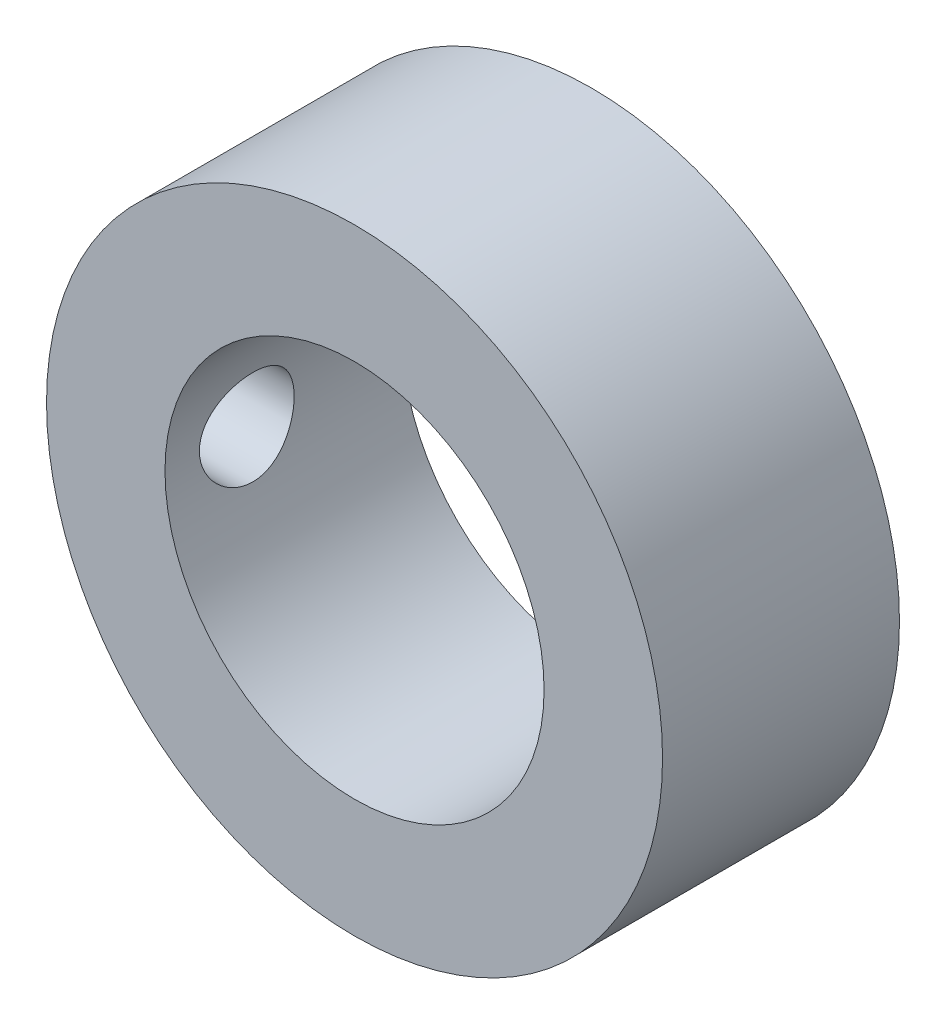
ISO-10303-21;
HEADER;
FILE_DESCRIPTION(('STEP AP214'),'2;1');
FILE_NAME('part.step','',(''),(''),'','','');
FILE_SCHEMA(('AUTOMOTIVE_DESIGN { 1 0 10303 214 1 1 1 1 }'));
ENDSEC;
DATA;
#1=APPLICATION_CONTEXT('core data for automotive mechanical design processes');
#2=APPLICATION_PROTOCOL_DEFINITION('international standard','automotive_design',2000,#1);
#3=PRODUCT_CONTEXT('',#1,'mechanical');
#4=PRODUCT('Part','Part','',(#3));
#5=PRODUCT_RELATED_PRODUCT_CATEGORY('part','',(#4));
#6=PRODUCT_DEFINITION_FORMATION('','',#4);
#7=PRODUCT_DEFINITION_CONTEXT('part definition',#1,'design');
#8=PRODUCT_DEFINITION('design','',#6,#7);
#9=PRODUCT_DEFINITION_SHAPE('','',#8);
#10=(LENGTH_UNIT() NAMED_UNIT(*) SI_UNIT(.MILLI.,.METRE.));
#11=(NAMED_UNIT(*) PLANE_ANGLE_UNIT() SI_UNIT($,.RADIAN.));
#12=(NAMED_UNIT(*) SI_UNIT($,.STERADIAN.) SOLID_ANGLE_UNIT());
#13=UNCERTAINTY_MEASURE_WITH_UNIT(LENGTH_MEASURE(1.E-05),#10,'distance_accuracy_value','');
#14=(GEOMETRIC_REPRESENTATION_CONTEXT(3) GLOBAL_UNCERTAINTY_ASSIGNED_CONTEXT((#13)) GLOBAL_UNIT_ASSIGNED_CONTEXT((#10,
#11,#12)) REPRESENTATION_CONTEXT('',''));
#15=CARTESIAN_POINT('',(0.,0.,0.));
#16=DIRECTION('',(0.,0.,1.));
#17=DIRECTION('',(1.,0.,0.));
#18=AXIS2_PLACEMENT_3D('',#15,#16,#17);
#19=CARTESIAN_POINT('',(0.,0.,5.));
#20=DIRECTION('',(0.,0.,1.));
#21=DIRECTION('',(1.,0.,0.));
#22=AXIS2_PLACEMENT_3D('',#19,#20,#21);
#23=PLANE('',#22);
#24=CARTESIAN_POINT('',(0.,0.,5.));
#25=DIRECTION('',(0.,0.,1.));
#26=DIRECTION('',(1.,0.,0.));
#27=AXIS2_PLACEMENT_3D('',#24,#25,#26);
#28=CIRCLE('',#27,6.5);
#29=CARTESIAN_POINT('',(6.5,0.,5.));
#30=VERTEX_POINT('',#29);
#31=EDGE_CURVE('E10',#30,#30,#28,.T.);
#32=ORIENTED_EDGE('',*,*,#31,.T.);
#33=EDGE_LOOP('',(#32));
#34=FACE_BOUND('',#33,.T.);
#35=CARTESIAN_POINT('',(0.,0.,5.));
#36=DIRECTION('',(0.,0.,1.));
#37=DIRECTION('',(1.,0.,0.));
#38=AXIS2_PLACEMENT_3D('',#35,#36,#37);
#39=CIRCLE('',#38,4.);
#40=CARTESIAN_POINT('',(4.,0.,5.));
#41=VERTEX_POINT('',#40);
#42=EDGE_CURVE('E47',#41,#41,#39,.T.);
#43=ORIENTED_EDGE('',*,*,#42,.F.);
#44=EDGE_LOOP('',(#43));
#45=FACE_BOUND('',#44,.T.);
#46=ADVANCED_FACE('F29',(#34,#45),#23,.T.);
#47=CARTESIAN_POINT('',(0.,0.,0.));
#48=DIRECTION('',(0.,0.,1.));
#49=DIRECTION('',(1.,0.,0.));
#50=AXIS2_PLACEMENT_3D('',#47,#48,#49);
#51=PLANE('',#50);
#52=CARTESIAN_POINT('',(0.,0.,0.));
#53=DIRECTION('',(0.,0.,1.));
#54=DIRECTION('',(1.,0.,0.));
#55=AXIS2_PLACEMENT_3D('',#52,#53,#54);
#56=CIRCLE('',#55,6.5);
#57=CARTESIAN_POINT('',(6.5,0.,0.));
#58=VERTEX_POINT('',#57);
#59=EDGE_CURVE('E42',#58,#58,#56,.T.);
#60=ORIENTED_EDGE('',*,*,#59,.F.);
#61=EDGE_LOOP('',(#60));
#62=FACE_BOUND('',#61,.T.);
#63=CARTESIAN_POINT('',(0.,0.,0.));
#64=DIRECTION('',(0.,0.,1.));
#65=DIRECTION('',(1.,0.,0.));
#66=AXIS2_PLACEMENT_3D('',#63,#64,#65);
#67=CIRCLE('',#66,4.);
#68=CARTESIAN_POINT('',(4.,0.,0.));
#69=VERTEX_POINT('',#68);
#70=EDGE_CURVE('E49',#69,#69,#67,.T.);
#71=ORIENTED_EDGE('',*,*,#70,.T.);
#72=EDGE_LOOP('',(#71));
#73=FACE_BOUND('',#72,.T.);
#74=ADVANCED_FACE('F69',(#62,#73),#51,.F.);
#75=CARTESIAN_POINT('',(0.,0.,5.));
#76=DIRECTION('',(0.,0.,-1.));
#77=DIRECTION('',(-1.,0.,0.));
#78=AXIS2_PLACEMENT_3D('',#75,#76,#77);
#79=CYLINDRICAL_SURFACE('',#78,6.5);
#80=CARTESIAN_POINT('',(-6.5,0.,2.27451248703502));
#81=CARTESIAN_POINT('',(-6.49999908992167,0.055817064729886,2.27451477553336));
#82=CARTESIAN_POINT('',(-6.49927350343274,0.11166609146456,2.2792015833515));
#83=CARTESIAN_POINT('',(-6.49644883563929,0.221801899824004,2.29781956022329));
#84=CARTESIAN_POINT('',(-6.49434843348197,0.276087126613348,2.31175961951114));
#85=CARTESIAN_POINT('',(-6.48901007251788,0.381485610883513,2.34845670936924));
#86=CARTESIAN_POINT('',(-6.48577298944175,0.432601274714583,2.37120695371138));
#87=CARTESIAN_POINT('',(-6.47851856984632,0.530282085271046,2.42486176451074));
#88=CARTESIAN_POINT('',(-6.47450133744396,0.576847837971894,2.45576524305334));
#89=CARTESIAN_POINT('',(-6.46609620155979,0.664496386012373,2.52511921389002));
#90=CARTESIAN_POINT('',(-6.46170579545351,0.705536460731055,2.56362339830884));
#91=CARTESIAN_POINT('',(-6.45306862956897,0.780599991187495,2.6469702378492));
#92=CARTESIAN_POINT('',(-6.44882187823779,0.814623034912151,2.69181326490282));
#93=CARTESIAN_POINT('',(-6.44092858480929,0.874854121170247,2.78685334842795));
#94=CARTESIAN_POINT('',(-6.43728527709901,0.901020625150246,2.83707702166757));
#95=CARTESIAN_POINT('',(-6.43104567686631,0.94453036662908,2.9412719265677));
#96=CARTESIAN_POINT('',(-6.42844932428087,0.961874110297863,2.99524294303772));
#97=CARTESIAN_POINT('',(-6.4246222788149,0.987112895661808,3.10495038251229));
#98=CARTESIAN_POINT('',(-6.42338100001967,0.995081217378878,3.1606695709776));
#99=CARTESIAN_POINT('',(-6.42237253279063,1.00157002465742,3.27266695198738));
#100=CARTESIAN_POINT('',(-6.42260525537728,1.00009108051243,3.32894511058429));
#101=CARTESIAN_POINT('',(-6.42450881933126,0.987787179811824,3.43994403886675));
#102=CARTESIAN_POINT('',(-6.42616707775449,0.977043994441648,3.49467411958995));
#103=CARTESIAN_POINT('',(-6.43071520435033,0.946644646972411,3.60154552816723));
#104=CARTESIAN_POINT('',(-6.43360510901605,0.926988220777025,3.65368677926436));
#105=CARTESIAN_POINT('',(-6.44030473958811,0.879235795084032,3.75414833588555));
#106=CARTESIAN_POINT('',(-6.44411821123387,0.851105310804899,3.8024519897075));
#107=CARTESIAN_POINT('',(-6.4522326103619,0.78722783237411,3.89368436170275));
#108=CARTESIAN_POINT('',(-6.45653357146213,0.751480312791105,3.93661270875706));
#109=CARTESIAN_POINT('',(-6.46519386756059,0.67293538705475,4.01634967565635));
#110=CARTESIAN_POINT('',(-6.469553340338,0.630067708624352,4.05308909407197));
#111=CARTESIAN_POINT('',(-6.47779744041346,0.538738417865615,4.11886293895054));
#112=CARTESIAN_POINT('',(-6.48168206543197,0.490276778685255,4.14789732842575));
#113=CARTESIAN_POINT('',(-6.488543145454,0.389074104610937,4.19744109963044));
#114=CARTESIAN_POINT('',(-6.4915190130639,0.336330329631682,4.21794497057715));
#115=CARTESIAN_POINT('',(-6.496222414473,0.228092040845377,4.24978461540683));
#116=CARTESIAN_POINT('',(-6.49795003709237,0.172597723056377,4.26112104161565));
#117=CARTESIAN_POINT('',(-6.49995048880449,0.0610307068281496,4.27421158112463));
#118=CARTESIAN_POINT('',(-6.50023775644299,0.00496941707415943,4.27606080136799));
#119=CARTESIAN_POINT('',(-6.49936448789232,-0.106662529346365,4.27037712723291));
#120=CARTESIAN_POINT('',(-6.49820399892325,-0.162233201955357,4.26284453885197));
#121=CARTESIAN_POINT('',(-6.49457454189283,-0.271017124248255,4.23869016173058));
#122=CARTESIAN_POINT('',(-6.49211227023231,-0.32424094186448,4.2221148750519));
#123=CARTESIAN_POINT('',(-6.48615438698457,-0.427154143969837,4.18039476985395));
#124=CARTESIAN_POINT('',(-6.48265872470663,-0.476843354928232,4.15524953094524));
#125=CARTESIAN_POINT('',(-6.47498649883332,-0.57169392957572,4.09688135364179));
#126=CARTESIAN_POINT('',(-6.47080494696501,-0.616817882496432,4.06359828915746));
#127=CARTESIAN_POINT('',(-6.46224144209134,-0.700873697592618,3.98998273232548));
#128=CARTESIAN_POINT('',(-6.45785947681222,-0.739805179872141,3.94964980780106));
#129=CARTESIAN_POINT('',(-6.44934303476859,-0.81071843588531,3.86265532156035));
#130=CARTESIAN_POINT('',(-6.44521106232414,-0.842636341270653,3.81594141500798));
#131=CARTESIAN_POINT('',(-6.43770733047634,-0.898172001876273,3.71775929880923));
#132=CARTESIAN_POINT('',(-6.43433554970647,-0.92178999039054,3.66629122284436));
#133=CARTESIAN_POINT('',(-6.42875224541018,-0.959957166104304,3.56024956954266));
#134=CARTESIAN_POINT('',(-6.42653647836275,-0.97453955891243,3.50568817711425));
#135=CARTESIAN_POINT('',(-6.42350493549769,-0.994327036223546,3.39485398093342));
#136=CARTESIAN_POINT('',(-6.42268905751876,-0.999532805016491,3.33858130237254));
#137=CARTESIAN_POINT('',(-6.42255361649409,-1.00040235728518,3.22655875191229));
#138=CARTESIAN_POINT('',(-6.42321830228211,-0.996166585462345,3.17080965286747));
#139=CARTESIAN_POINT('',(-6.42593479927824,-0.97848897403827,3.06082688200797));
#140=CARTESIAN_POINT('',(-6.42798660779263,-0.965047152314781,3.00659320725061));
#141=CARTESIAN_POINT('',(-6.43324054942212,-0.929375191043097,2.90121106641621));
#142=CARTESIAN_POINT('',(-6.43644171586274,-0.907152435178954,2.85006004974548));
#143=CARTESIAN_POINT('',(-6.44363480220168,-0.854559485882902,2.75219615254446));
#144=CARTESIAN_POINT('',(-6.44762675166756,-0.824188987789906,2.70548343806001));
#145=CARTESIAN_POINT('',(-6.45600209982988,-0.755799150201771,2.61731243846299));
#146=CARTESIAN_POINT('',(-6.46038905079967,-0.717705522953786,2.57591210505067));
#147=CARTESIAN_POINT('',(-6.46903074380989,-0.635107757993179,2.50005610605368));
#148=CARTESIAN_POINT('',(-6.47328545494089,-0.590602135052723,2.46560205390358));
#149=CARTESIAN_POINT('',(-6.4812116043899,-0.496138861148413,2.40443687997911));
#150=CARTESIAN_POINT('',(-6.48487951200506,-0.446151049768046,2.37777188533883));
#151=CARTESIAN_POINT('',(-6.4911842414916,-0.342372563409436,2.33325675532085));
#152=CARTESIAN_POINT('',(-6.49382212163167,-0.288585858953371,2.31539756771453));
#153=CARTESIAN_POINT('',(-6.49717328640608,-0.195470700034543,2.29301391830033));
#154=CARTESIAN_POINT('',(-6.49822781110073,-0.156714587663259,2.28608659630501));
#155=CARTESIAN_POINT('',(-6.49964148386525,-0.0786442681971829,2.27683510528157));
#156=CARTESIAN_POINT('',(-6.50000064126345,-0.0393300685962364,2.27451087450313));
#157=CARTESIAN_POINT('',(-6.5,0.,2.27451248703502));
#158=B_SPLINE_CURVE_WITH_KNOTS('',3,(#80,#81,#82,#83,#84,#85,#86,#87,#88,#89,#90,#91,#92,#93,
#94,#95,#96,#97,#98,#99,#100,#101,#102,#103,#104,#105,#106,#107,#108,#109,#110,#111,#112,#113,
#114,#115,#116,#117,#118,#119,#120,#121,#122,#123,#124,#125,#126,#127,#128,#129,#130,#131,#132,
#133,#134,#135,#136,#137,#138,#139,#140,#141,#142,#143,#144,#145,#146,#147,#148,#149,#150,#151,
#152,#153,#154,#155,#156,#157),.UNSPECIFIED.,.T.,.F.,(4,2,2,2,2,2,2,2,2,2,2,2,2,2,2,2,2,2,2,2,2,
2,2,2,2,2,2,2,2,2,2,2,2,2,2,2,2,2,4),(0.,0.167307467701377,0.334775912289476,0.502115616587677,
0.669433003445578,0.837977603302102,1.00653209663435,1.17596267229177,1.34538352646323,
1.51347116858973,1.68154866403561,1.84815762731508,2.01477152748461,2.18207283092673,
2.34938567873227,2.51846034912151,2.68753583113344,2.85672036828736,3.02589286575468,
3.19336608917139,3.36083385041674,3.52744841736623,3.69407115858382,3.86196430272231,
4.02986774280723,4.1992420476724,4.36861159138526,4.53735495577967,4.70608600507342,
4.87303057013561,5.03997481099962,5.20677897004386,5.37358936711325,5.54208769222918,
5.71062511000444,5.88014126810578,6.04948280110168,6.16737331520001,6.28526224779081),.UNSPECIFIED.);
#159=CARTESIAN_POINT('',(-6.5,0.,2.27451248703502));
#160=VERTEX_POINT('',#159);
#161=EDGE_CURVE('E52',#160,#160,#158,.T.);
#162=ORIENTED_EDGE('',*,*,#161,.T.);
#163=EDGE_LOOP('',(#162));
#164=FACE_BOUND('',#163,.T.);
#165=ORIENTED_EDGE('',*,*,#31,.F.);
#166=EDGE_LOOP('',(#165));
#167=FACE_BOUND('',#166,.T.);
#168=ORIENTED_EDGE('',*,*,#59,.T.);
#169=EDGE_LOOP('',(#168));
#170=FACE_BOUND('',#169,.T.);
#171=ADVANCED_FACE('F31',(#164,#167,#170),#79,.T.);
#172=CARTESIAN_POINT('',(0.,0.,5.));
#173=DIRECTION('',(0.,0.,-1.));
#174=DIRECTION('',(-1.,0.,0.));
#175=AXIS2_PLACEMENT_3D('',#172,#173,#174);
#176=CYLINDRICAL_SURFACE('',#175,4.);
#177=CARTESIAN_POINT('',(-4.,0.,4.27451248703502));
#178=CARTESIAN_POINT('',(-3.99999906578675,-0.0552507257798207,4.27451093654292));
#179=CARTESIAN_POINT('',(-3.99884385421219,-0.110518771887175,4.2699181198525));
#180=CARTESIAN_POINT('',(-3.99434742553261,-0.219470882513688,4.25169571949702));
#181=CARTESIAN_POINT('',(-3.99100496946646,-0.273154031247159,4.23806101400979));
#182=CARTESIAN_POINT('',(-3.98250417554693,-0.377347248121718,4.20221965139363));
#183=CARTESIAN_POINT('',(-3.97734801894725,-0.427861042286669,4.1800232878915));
#184=CARTESIAN_POINT('',(-3.96576895871729,-0.524448087936284,4.1277248936718));
#185=CARTESIAN_POINT('',(-3.95934601236034,-0.57052118956584,4.09762259628906));
#186=CARTESIAN_POINT('',(-3.94578275727868,-0.657867951533947,4.02971196059888));
#187=CARTESIAN_POINT('',(-3.93863138099022,-0.699037126707381,3.99177143706224));
#188=CARTESIAN_POINT('',(-3.92449080078353,-0.774499284802203,3.90954435042908));
#189=CARTESIAN_POINT('',(-3.91750161525566,-0.808791491299423,3.86525707173736));
#190=CARTESIAN_POINT('',(-3.9043651713314,-0.870017695199355,3.77078233587673));
#191=CARTESIAN_POINT('',(-3.89823196313737,-0.896834810616904,3.72051699982808));
#192=CARTESIAN_POINT('',(-3.88766329874815,-0.941597939033685,3.61601354592945));
#193=CARTESIAN_POINT('',(-3.88322757115193,-0.959545370292888,3.56177606481785));
#194=CARTESIAN_POINT('',(-3.87666984478367,-0.985703224536194,3.4520168215667));
#195=CARTESIAN_POINT('',(-3.87450327383617,-0.994101512222226,3.39654255633516));
#196=CARTESIAN_POINT('',(-3.8725957502516,-1.00150785004523,3.2849334410257));
#197=CARTESIAN_POINT('',(-3.87285440299096,-1.00051742787865,3.22879869990261));
#198=CARTESIAN_POINT('',(-3.87572803664412,-0.989324349759521,3.1189019485387));
#199=CARTESIAN_POINT('',(-3.87828575334586,-0.979345560127014,3.06511540605829));
#200=CARTESIAN_POINT('',(-3.88537806450989,-0.950816124602071,2.96000511976083));
#201=CARTESIAN_POINT('',(-3.88991279980464,-0.932264868046282,2.90868155168236));
#202=CARTESIAN_POINT('',(-3.90050075936124,-0.886926318624769,2.80935380953364));
#203=CARTESIAN_POINT('',(-3.90656884979614,-0.860057778155274,2.76138837250865));
#204=CARTESIAN_POINT('',(-3.91953140564257,-0.79890418400997,2.67056668053046));
#205=CARTESIAN_POINT('',(-3.9264260155649,-0.764617832539226,2.62771132165685));
#206=CARTESIAN_POINT('',(-3.94050587026521,-0.688442283120812,2.54704340990542));
#207=CARTESIAN_POINT('',(-3.94769379651981,-0.646364172110574,2.50940949366079));
#208=CARTESIAN_POINT('',(-3.96137310385857,-0.556407945002467,2.44169832539242));
#209=CARTESIAN_POINT('',(-3.96786446366277,-0.508529651805296,2.41162130419264));
#210=CARTESIAN_POINT('',(-3.97945154729455,-0.408077259120928,2.35981209621876));
#211=CARTESIAN_POINT('',(-3.9845424008515,-0.355487595472416,2.3381089268654));
#212=CARTESIAN_POINT('',(-3.99271944660946,-0.247250672095255,2.30390094989531));
#213=CARTESIAN_POINT('',(-3.99580602226187,-0.191603999433656,2.29139438275626));
#214=CARTESIAN_POINT('',(-3.9995699951425,-0.0803599802600179,2.27620744332913));
#215=CARTESIAN_POINT('',(-4.00030702338852,-0.0247978133254733,2.27328380298482));
#216=CARTESIAN_POINT('',(-3.999458698763,0.0860219165343386,2.27667848840534));
#217=CARTESIAN_POINT('',(-3.99787355494564,0.14127950642973,2.28299598223444));
#218=CARTESIAN_POINT('',(-3.99259720751571,0.249076179184328,2.30449309262927));
#219=CARTESIAN_POINT('',(-3.98893756123874,0.301643412645837,2.31953999601968));
#220=CARTESIAN_POINT('',(-3.97992471089423,0.403504861635008,2.35791720972065));
#221=CARTESIAN_POINT('',(-3.97457133579928,0.452798746021757,2.38124835657713));
#222=CARTESIAN_POINT('',(-3.96262205284207,0.547682089619898,2.43600323961817));
#223=CARTESIAN_POINT('',(-3.95600578244621,0.59319029455722,2.46756322863286));
#224=CARTESIAN_POINT('',(-3.94229672791613,0.678351075762164,2.53770575956633));
#225=CARTESIAN_POINT('',(-3.93520386167803,0.718002639315339,2.57628951344629));
#226=CARTESIAN_POINT('',(-3.92112637973847,0.79132704538182,2.66051379426466));
#227=CARTESIAN_POINT('',(-3.91414869458187,0.824829245081355,2.70630428903663));
#228=CARTESIAN_POINT('',(-3.90128585584826,0.883673839341798,2.80300091001217));
#229=CARTESIAN_POINT('',(-3.89540065378017,0.909016596105291,2.85390680900819));
#230=CARTESIAN_POINT('',(-3.88545396489777,0.950634280406195,2.95911630197707));
#231=CARTESIAN_POINT('',(-3.88138170194604,0.96696293110271,3.01339757259769));
#232=CARTESIAN_POINT('',(-3.87551162726789,0.990230439969186,3.12405224562776));
#233=CARTESIAN_POINT('',(-3.87371331813291,0.997171351652438,3.18042518772335));
#234=CARTESIAN_POINT('',(-3.87263267469304,1.00135906022266,3.29192650293849));
#235=CARTESIAN_POINT('',(-3.87327955152176,0.998878598520079,3.34704411045151));
#236=CARTESIAN_POINT('',(-3.87685272671895,0.984918185541911,3.45604841281367));
#237=CARTESIAN_POINT('',(-3.87977897927904,0.973438415124513,3.50993513237745));
#238=CARTESIAN_POINT('',(-3.88754173788482,0.941954212961863,3.61465145974529));
#239=CARTESIAN_POINT('',(-3.89236676824206,0.922000936453584,3.66549735719516));
#240=CARTESIAN_POINT('',(-3.90338503816552,0.874176609070047,3.76315607551081));
#241=CARTESIAN_POINT('',(-3.90957846747182,0.846304460022792,3.8099683358263));
#242=CARTESIAN_POINT('',(-3.92283756175675,0.782578499091424,3.8995489063697));
#243=CARTESIAN_POINT('',(-3.92992176554505,0.746535441941503,3.94217986931766));
#244=CARTESIAN_POINT('',(-3.94405351497524,0.667859580793157,4.02087718356529));
#245=CARTESIAN_POINT('',(-3.95110105151373,0.625225214174097,4.056941973777));
#246=CARTESIAN_POINT('',(-3.96451770431775,0.533645057801727,4.12212002607809));
#247=CARTESIAN_POINT('',(-3.97087222243912,0.484598948210924,4.15109556281607));
#248=CARTESIAN_POINT('',(-3.98203283316746,0.382177373006984,4.20034412899537));
#249=CARTESIAN_POINT('',(-3.98684003466521,0.32880504229116,4.22062339413404));
#250=CARTESIAN_POINT('',(-3.99365373043694,0.229606835495648,4.24889370725479));
#251=CARTESIAN_POINT('',(-3.9960172336846,0.184253447272046,4.25847998240398));
#252=CARTESIAN_POINT('',(-3.99919070154632,0.0926040476908553,4.27128978278298));
#253=CARTESIAN_POINT('',(-4.00000078300596,0.0463081074950775,4.27451378657189));
#254=CARTESIAN_POINT('',(-4.,0.,4.27451248703502));
#255=B_SPLINE_CURVE_WITH_KNOTS('',3,(#177,#178,#179,#180,#181,#182,#183,#184,#185,#186,#187,
#188,#189,#190,#191,#192,#193,#194,#195,#196,#197,#198,#199,#200,#201,#202,#203,#204,#205,#206,
#207,#208,#209,#210,#211,#212,#213,#214,#215,#216,#217,#218,#219,#220,#221,#222,#223,#224,#225,
#226,#227,#228,#229,#230,#231,#232,#233,#234,#235,#236,#237,#238,#239,#240,#241,#242,#243,#244,
#245,#246,#247,#248,#249,#250,#251,#252,#253,#254),.UNSPECIFIED.,.T.,.F.,(4,2,2,2,2,2,2,2,2,2,2,
2,2,2,2,2,2,2,2,2,2,2,2,2,2,2,2,2,2,2,2,2,2,2,2,2,2,2,4),(0.,0.16558247498126,0.331258825175933,
0.496736601524071,0.662219960112886,0.83076290291426,0.999324863867079,1.17039098363871,
1.34142974112912,1.50904196732954,1.67662692075131,1.84014998004679,2.00368468977359,
2.16887018582586,2.33408460557442,2.50401000646013,2.67394059705498,2.84445486006076,
3.01493649125762,3.18105539299517,3.34715934075162,3.51080183009358,3.67446084881527,
3.84102391710235,4.00761575338679,4.17829672802984,4.34897012499672,4.51861503076024,
4.68822282168272,4.85295853599075,5.0176909397069,5.18144267039631,5.34521712091267,
5.51326384273273,5.68135046513612,5.85248123666392,6.02348909214233,6.16228161961433,
6.3010637069536),.UNSPECIFIED.);
#256=CARTESIAN_POINT('',(-4.,0.,4.27451248703502));
#257=VERTEX_POINT('',#256);
#258=EDGE_CURVE('E34',#257,#257,#255,.T.);
#259=ORIENTED_EDGE('',*,*,#258,.F.);
#260=EDGE_LOOP('',(#259));
#261=FACE_BOUND('',#260,.T.);
#262=ORIENTED_EDGE('',*,*,#42,.T.);
#263=EDGE_LOOP('',(#262));
#264=FACE_BOUND('',#263,.T.);
#265=ORIENTED_EDGE('',*,*,#70,.F.);
#266=EDGE_LOOP('',(#265));
#267=FACE_BOUND('',#266,.T.);
#268=ADVANCED_FACE('F61',(#261,#264,#267),#176,.F.);
#269=CARTESIAN_POINT('',(-6.5,0.,3.27451248703502));
#270=DIRECTION('',(1.,0.,0.));
#271=DIRECTION('',(0.,0.,-1.));
#272=AXIS2_PLACEMENT_3D('',#269,#270,#271);
#273=CYLINDRICAL_SURFACE('',#272,1.);
#274=ORIENTED_EDGE('',*,*,#258,.T.);
#275=EDGE_LOOP('',(#274));
#276=FACE_BOUND('',#275,.T.);
#277=ORIENTED_EDGE('',*,*,#161,.F.);
#278=EDGE_LOOP('',(#277));
#279=FACE_BOUND('',#278,.T.);
#280=ADVANCED_FACE('F58',(#276,#279),#273,.F.);
#281=CLOSED_SHELL('',(#46,#74,#171,#268,#280));
#282=MANIFOLD_SOLID_BREP('B2',#281);
#283=ADVANCED_BREP_SHAPE_REPRESENTATION('',(#18,#282),#14);
#284=SHAPE_DEFINITION_REPRESENTATION(#9,#283);
ENDSEC;
END-ISO-10303-21;
